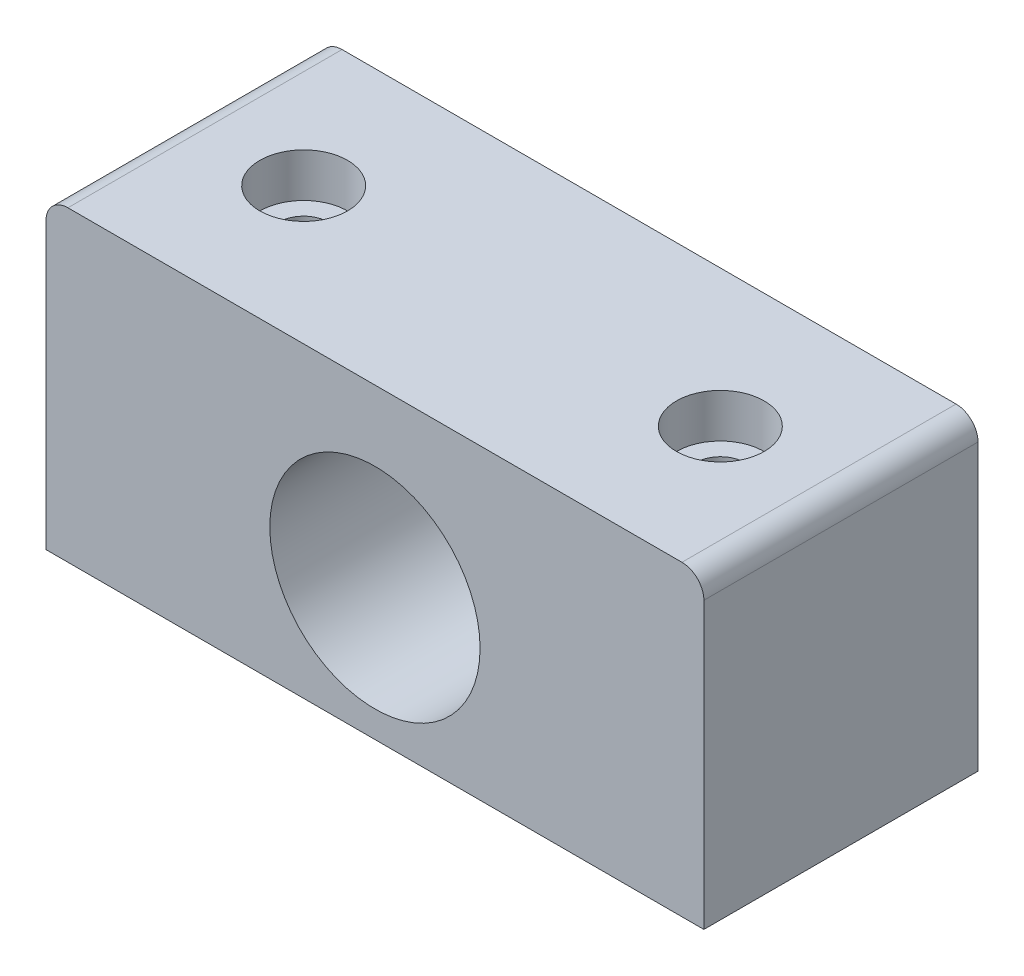
ISO-10303-21;
HEADER;
FILE_DESCRIPTION(('STEP AP214'),'2;1');
FILE_NAME('part.step','',(''),(''),'','','');
FILE_SCHEMA(('AUTOMOTIVE_DESIGN { 1 0 10303 214 1 1 1 1 }'));
ENDSEC;
DATA;
#1=APPLICATION_CONTEXT('core data for automotive mechanical design processes');
#2=APPLICATION_PROTOCOL_DEFINITION('international standard','automotive_design',2000,#1);
#3=PRODUCT_CONTEXT('',#1,'mechanical');
#4=PRODUCT('Part','Part','',(#3));
#5=PRODUCT_RELATED_PRODUCT_CATEGORY('part','',(#4));
#6=PRODUCT_DEFINITION_FORMATION('','',#4);
#7=PRODUCT_DEFINITION_CONTEXT('part definition',#1,'design');
#8=PRODUCT_DEFINITION('design','',#6,#7);
#9=PRODUCT_DEFINITION_SHAPE('','',#8);
#10=(LENGTH_UNIT() NAMED_UNIT(*) SI_UNIT(.MILLI.,.METRE.));
#11=(NAMED_UNIT(*) PLANE_ANGLE_UNIT() SI_UNIT($,.RADIAN.));
#12=(NAMED_UNIT(*) SI_UNIT($,.STERADIAN.) SOLID_ANGLE_UNIT());
#13=UNCERTAINTY_MEASURE_WITH_UNIT(LENGTH_MEASURE(1.E-05),#10,'distance_accuracy_value','');
#14=(GEOMETRIC_REPRESENTATION_CONTEXT(3) GLOBAL_UNCERTAINTY_ASSIGNED_CONTEXT((#13)) GLOBAL_UNIT_ASSIGNED_CONTEXT((#10,
#11,#12)) REPRESENTATION_CONTEXT('',''));
#15=CARTESIAN_POINT('',(0.,0.,0.));
#16=DIRECTION('',(0.,0.,1.));
#17=DIRECTION('',(1.,0.,0.));
#18=AXIS2_PLACEMENT_3D('',#15,#16,#17);
#19=CARTESIAN_POINT('',(30.,28.,12.5));
#20=DIRECTION('',(-1.,0.,0.));
#21=DIRECTION('',(0.,0.,1.));
#22=AXIS2_PLACEMENT_3D('',#19,#20,#21);
#23=PLANE('',#22);
#24=DIRECTION('',(0.,-1.,0.));
#25=VECTOR('',#24,1.);
#26=CARTESIAN_POINT('',(30.,28.,-12.5));
#27=LINE('',#26,#25);
#28=CARTESIAN_POINT('',(30.,26.,-12.5));
#29=VERTEX_POINT('',#28);
#30=CARTESIAN_POINT('',(30.,0.,-12.5));
#31=VERTEX_POINT('',#30);
#32=EDGE_CURVE('E85',#29,#31,#27,.T.);
#33=ORIENTED_EDGE('',*,*,#32,.F.);
#34=DIRECTION('',(0.,0.,-1.));
#35=VECTOR('',#34,1.);
#36=CARTESIAN_POINT('',(30.,26.,12.5));
#37=LINE('',#36,#35);
#38=CARTESIAN_POINT('',(30.,26.,12.5));
#39=VERTEX_POINT('',#38);
#40=EDGE_CURVE('E56',#29,#39,#37,.F.);
#41=ORIENTED_EDGE('',*,*,#40,.T.);
#42=DIRECTION('',(0.,-1.,0.));
#43=VECTOR('',#42,1.);
#44=CARTESIAN_POINT('',(30.,28.,12.5));
#45=LINE('',#44,#43);
#46=CARTESIAN_POINT('',(30.,0.,12.5));
#47=VERTEX_POINT('',#46);
#48=EDGE_CURVE('E105',#39,#47,#45,.T.);
#49=ORIENTED_EDGE('',*,*,#48,.T.);
#50=DIRECTION('',(0.,0.,-1.));
#51=VECTOR('',#50,1.);
#52=CARTESIAN_POINT('',(30.,0.,12.5));
#53=LINE('',#52,#51);
#54=EDGE_CURVE('E101',#47,#31,#53,.T.);
#55=ORIENTED_EDGE('',*,*,#54,.T.);
#56=EDGE_LOOP('',(#33,#41,#49,#55));
#57=FACE_BOUND('',#56,.T.);
#58=ADVANCED_FACE('F33',(#57),#23,.F.);
#59=CARTESIAN_POINT('',(-30.,28.,-12.5));
#60=DIRECTION('',(0.,0.,1.));
#61=DIRECTION('',(1.,0.,0.));
#62=AXIS2_PLACEMENT_3D('',#59,#60,#61);
#63=PLANE('',#62);
#64=CARTESIAN_POINT('',(0.,12.,-12.5));
#65=DIRECTION('',(0.,0.,1.));
#66=DIRECTION('',(1.,0.,0.));
#67=AXIS2_PLACEMENT_3D('',#64,#65,#66);
#68=CIRCLE('',#67,9.5885);
#69=CARTESIAN_POINT('',(9.5885,12.,-12.5));
#70=VERTEX_POINT('',#69);
#71=EDGE_CURVE('E107',#70,#70,#68,.T.);
#72=ORIENTED_EDGE('',*,*,#71,.T.);
#73=EDGE_LOOP('',(#72));
#74=FACE_BOUND('',#73,.T.);
#75=DIRECTION('',(-1.,0.,0.));
#76=VECTOR('',#75,1.);
#77=CARTESIAN_POINT('',(-30.,28.,-12.5));
#78=LINE('',#77,#76);
#79=CARTESIAN_POINT('',(28.,28.,-12.5));
#80=VERTEX_POINT('',#79);
#81=CARTESIAN_POINT('',(-28.,28.,-12.5));
#82=VERTEX_POINT('',#81);
#83=EDGE_CURVE('E119',#80,#82,#78,.T.);
#84=ORIENTED_EDGE('',*,*,#83,.F.);
#85=CARTESIAN_POINT('',(28.,26.,-12.5));
#86=DIRECTION('',(0.,0.,1.));
#87=DIRECTION('',(1.,0.,0.));
#88=AXIS2_PLACEMENT_3D('',#85,#86,#87);
#89=CIRCLE('',#88,2.);
#90=EDGE_CURVE('E92',#80,#29,#89,.F.);
#91=ORIENTED_EDGE('',*,*,#90,.T.);
#92=ORIENTED_EDGE('',*,*,#32,.T.);
#93=DIRECTION('',(-1.,0.,0.));
#94=VECTOR('',#93,1.);
#95=CARTESIAN_POINT('',(-30.,0.,-12.5));
#96=LINE('',#95,#94);
#97=CARTESIAN_POINT('',(-30.,0.,-12.5));
#98=VERTEX_POINT('',#97);
#99=EDGE_CURVE('E90',#31,#98,#96,.T.);
#100=ORIENTED_EDGE('',*,*,#99,.T.);
#101=DIRECTION('',(0.,-1.,0.));
#102=VECTOR('',#101,1.);
#103=CARTESIAN_POINT('',(-30.,28.,-12.5));
#104=LINE('',#103,#102);
#105=CARTESIAN_POINT('',(-30.,26.,-12.5));
#106=VERTEX_POINT('',#105);
#107=EDGE_CURVE('E95',#106,#98,#104,.T.);
#108=ORIENTED_EDGE('',*,*,#107,.F.);
#109=CARTESIAN_POINT('',(-28.,26.,-12.5));
#110=DIRECTION('',(0.,0.,1.));
#111=DIRECTION('',(1.,0.,0.));
#112=AXIS2_PLACEMENT_3D('',#109,#110,#111);
#113=CIRCLE('',#112,2.);
#114=EDGE_CURVE('E129',#106,#82,#113,.F.);
#115=ORIENTED_EDGE('',*,*,#114,.T.);
#116=EDGE_LOOP('',(#84,#91,#92,#100,#108,#115));
#117=FACE_BOUND('',#116,.T.);
#118=ADVANCED_FACE('F88',(#74,#117),#63,.F.);
#119=CARTESIAN_POINT('',(-30.,28.,12.5));
#120=DIRECTION('',(1.,0.,0.));
#121=DIRECTION('',(0.,0.,-1.));
#122=AXIS2_PLACEMENT_3D('',#119,#120,#121);
#123=PLANE('',#122);
#124=DIRECTION('',(0.,-1.,0.));
#125=VECTOR('',#124,1.);
#126=CARTESIAN_POINT('',(-30.,28.,12.5));
#127=LINE('',#126,#125);
#128=CARTESIAN_POINT('',(-30.,26.,12.5));
#129=VERTEX_POINT('',#128);
#130=CARTESIAN_POINT('',(-30.,0.,12.5));
#131=VERTEX_POINT('',#130);
#132=EDGE_CURVE('E121',#129,#131,#127,.T.);
#133=ORIENTED_EDGE('',*,*,#132,.F.);
#134=DIRECTION('',(0.,0.,1.));
#135=VECTOR('',#134,1.);
#136=CARTESIAN_POINT('',(-30.,26.,12.5));
#137=LINE('',#136,#135);
#138=EDGE_CURVE('E11',#129,#106,#137,.F.);
#139=ORIENTED_EDGE('',*,*,#138,.T.);
#140=ORIENTED_EDGE('',*,*,#107,.T.);
#141=DIRECTION('',(0.,0.,1.));
#142=VECTOR('',#141,1.);
#143=CARTESIAN_POINT('',(-30.,0.,12.5));
#144=LINE('',#143,#142);
#145=EDGE_CURVE('E103',#98,#131,#144,.T.);
#146=ORIENTED_EDGE('',*,*,#145,.T.);
#147=EDGE_LOOP('',(#133,#139,#140,#146));
#148=FACE_BOUND('',#147,.T.);
#149=ADVANCED_FACE('F158',(#148),#123,.F.);
#150=CARTESIAN_POINT('',(-30.,28.,12.5));
#151=DIRECTION('',(0.,0.,-1.));
#152=DIRECTION('',(-1.,0.,0.));
#153=AXIS2_PLACEMENT_3D('',#150,#151,#152);
#154=PLANE('',#153);
#155=CARTESIAN_POINT('',(0.,12.,12.5));
#156=DIRECTION('',(0.,0.,1.));
#157=DIRECTION('',(1.,0.,0.));
#158=AXIS2_PLACEMENT_3D('',#155,#156,#157);
#159=CIRCLE('',#158,9.5885);
#160=CARTESIAN_POINT('',(9.5885,12.,12.5));
#161=VERTEX_POINT('',#160);
#162=EDGE_CURVE('E110',#161,#161,#159,.T.);
#163=ORIENTED_EDGE('',*,*,#162,.F.);
#164=EDGE_LOOP('',(#163));
#165=FACE_BOUND('',#164,.T.);
#166=ORIENTED_EDGE('',*,*,#48,.F.);
#167=CARTESIAN_POINT('',(28.,26.,12.5));
#168=DIRECTION('',(0.,0.,-1.));
#169=DIRECTION('',(-1.,0.,0.));
#170=AXIS2_PLACEMENT_3D('',#167,#168,#169);
#171=CIRCLE('',#170,2.);
#172=CARTESIAN_POINT('',(28.,28.,12.5));
#173=VERTEX_POINT('',#172);
#174=EDGE_CURVE('E41',#39,#173,#171,.F.);
#175=ORIENTED_EDGE('',*,*,#174,.T.);
#176=DIRECTION('',(1.,0.,0.));
#177=VECTOR('',#176,1.);
#178=CARTESIAN_POINT('',(-30.,28.,12.5));
#179=LINE('',#178,#177);
#180=CARTESIAN_POINT('',(-28.,28.,12.5));
#181=VERTEX_POINT('',#180);
#182=EDGE_CURVE('E113',#181,#173,#179,.T.);
#183=ORIENTED_EDGE('',*,*,#182,.F.);
#184=CARTESIAN_POINT('',(-28.,26.,12.5));
#185=DIRECTION('',(0.,0.,-1.));
#186=DIRECTION('',(-1.,0.,0.));
#187=AXIS2_PLACEMENT_3D('',#184,#185,#186);
#188=CIRCLE('',#187,2.);
#189=EDGE_CURVE('E48',#181,#129,#188,.F.);
#190=ORIENTED_EDGE('',*,*,#189,.T.);
#191=ORIENTED_EDGE('',*,*,#132,.T.);
#192=DIRECTION('',(1.,0.,0.));
#193=VECTOR('',#192,1.);
#194=CARTESIAN_POINT('',(-30.,0.,12.5));
#195=LINE('',#194,#193);
#196=EDGE_CURVE('E117',#131,#47,#195,.T.);
#197=ORIENTED_EDGE('',*,*,#196,.T.);
#198=EDGE_LOOP('',(#166,#175,#183,#190,#191,#197));
#199=FACE_BOUND('',#198,.T.);
#200=ADVANCED_FACE('F135',(#165,#199),#154,.F.);
#201=CARTESIAN_POINT('',(0.,28.,0.));
#202=DIRECTION('',(0.,-1.,0.));
#203=DIRECTION('',(0.,0.,-1.));
#204=AXIS2_PLACEMENT_3D('',#201,#202,#203);
#205=PLANE('',#204);
#206=CARTESIAN_POINT('',(-19.,28.,0.));
#207=DIRECTION('',(0.,1.,0.));
#208=DIRECTION('',(0.,0.,1.));
#209=AXIS2_PLACEMENT_3D('',#206,#207,#208);
#210=CIRCLE('',#209,4.);
#211=CARTESIAN_POINT('',(-19.,28.,4.));
#212=VERTEX_POINT('',#211);
#213=EDGE_CURVE('E205',#212,#212,#210,.T.);
#214=ORIENTED_EDGE('',*,*,#213,.F.);
#215=EDGE_LOOP('',(#214));
#216=FACE_BOUND('',#215,.T.);
#217=CARTESIAN_POINT('',(19.,28.,0.));
#218=DIRECTION('',(0.,1.,0.));
#219=DIRECTION('',(0.,0.,1.));
#220=AXIS2_PLACEMENT_3D('',#217,#218,#219);
#221=CIRCLE('',#220,4.);
#222=CARTESIAN_POINT('',(19.,28.,4.));
#223=VERTEX_POINT('',#222);
#224=EDGE_CURVE('E214',#223,#223,#221,.T.);
#225=ORIENTED_EDGE('',*,*,#224,.F.);
#226=EDGE_LOOP('',(#225));
#227=FACE_BOUND('',#226,.T.);
#228=ORIENTED_EDGE('',*,*,#182,.T.);
#229=DIRECTION('',(0.,0.,-1.));
#230=VECTOR('',#229,1.);
#231=CARTESIAN_POINT('',(28.,28.,0.));
#232=LINE('',#231,#230);
#233=EDGE_CURVE('E126',#173,#80,#232,.T.);
#234=ORIENTED_EDGE('',*,*,#233,.T.);
#235=ORIENTED_EDGE('',*,*,#83,.T.);
#236=DIRECTION('',(0.,0.,1.));
#237=VECTOR('',#236,1.);
#238=CARTESIAN_POINT('',(-28.,28.,0.));
#239=LINE('',#238,#237);
#240=EDGE_CURVE('E94',#82,#181,#239,.T.);
#241=ORIENTED_EDGE('',*,*,#240,.T.);
#242=EDGE_LOOP('',(#228,#234,#235,#241));
#243=FACE_BOUND('',#242,.T.);
#244=ADVANCED_FACE('F139',(#216,#227,#243),#205,.F.);
#245=CARTESIAN_POINT('',(0.,0.,0.));
#246=DIRECTION('',(0.,-1.,0.));
#247=DIRECTION('',(0.,0.,-1.));
#248=AXIS2_PLACEMENT_3D('',#245,#246,#247);
#249=PLANE('',#248);
#250=CARTESIAN_POINT('',(-19.,0.,0.));
#251=DIRECTION('',(0.,1.,0.));
#252=DIRECTION('',(0.,0.,1.));
#253=AXIS2_PLACEMENT_3D('',#250,#251,#252);
#254=CIRCLE('',#253,2.25);
#255=CARTESIAN_POINT('',(-19.,0.,2.25));
#256=VERTEX_POINT('',#255);
#257=EDGE_CURVE('E207',#256,#256,#254,.T.);
#258=ORIENTED_EDGE('',*,*,#257,.T.);
#259=EDGE_LOOP('',(#258));
#260=FACE_BOUND('',#259,.T.);
#261=CARTESIAN_POINT('',(19.,0.,0.));
#262=DIRECTION('',(0.,1.,0.));
#263=DIRECTION('',(0.,0.,1.));
#264=AXIS2_PLACEMENT_3D('',#261,#262,#263);
#265=CIRCLE('',#264,2.25);
#266=CARTESIAN_POINT('',(19.,0.,2.25));
#267=VERTEX_POINT('',#266);
#268=EDGE_CURVE('E223',#267,#267,#265,.T.);
#269=ORIENTED_EDGE('',*,*,#268,.T.);
#270=EDGE_LOOP('',(#269));
#271=FACE_BOUND('',#270,.T.);
#272=ORIENTED_EDGE('',*,*,#54,.F.);
#273=ORIENTED_EDGE('',*,*,#196,.F.);
#274=ORIENTED_EDGE('',*,*,#145,.F.);
#275=ORIENTED_EDGE('',*,*,#99,.F.);
#276=EDGE_LOOP('',(#272,#273,#274,#275));
#277=FACE_BOUND('',#276,.T.);
#278=ADVANCED_FACE('F99',(#260,#271,#277),#249,.T.);
#279=CARTESIAN_POINT('',(0.,12.,-12.5));
#280=DIRECTION('',(0.,0.,1.));
#281=DIRECTION('',(1.,0.,0.));
#282=AXIS2_PLACEMENT_3D('',#279,#280,#281);
#283=CYLINDRICAL_SURFACE('',#282,9.5885);
#284=ORIENTED_EDGE('',*,*,#71,.F.);
#285=EDGE_LOOP('',(#284));
#286=FACE_BOUND('',#285,.T.);
#287=ORIENTED_EDGE('',*,*,#162,.T.);
#288=EDGE_LOOP('',(#287));
#289=FACE_BOUND('',#288,.T.);
#290=ADVANCED_FACE('F170',(#286,#289),#283,.F.);
#291=CARTESIAN_POINT('',(19.,28.,0.));
#292=DIRECTION('',(0.,1.,0.));
#293=DIRECTION('',(0.,0.,1.));
#294=AXIS2_PLACEMENT_3D('',#291,#292,#293);
#295=CYLINDRICAL_SURFACE('',#294,2.25);
#296=ORIENTED_EDGE('',*,*,#268,.F.);
#297=EDGE_LOOP('',(#296));
#298=FACE_BOUND('',#297,.T.);
#299=CARTESIAN_POINT('',(19.,24.,0.));
#300=DIRECTION('',(0.,1.,0.));
#301=DIRECTION('',(0.,0.,1.));
#302=AXIS2_PLACEMENT_3D('',#299,#300,#301);
#303=CIRCLE('',#302,2.25);
#304=CARTESIAN_POINT('',(19.,24.,2.25));
#305=VERTEX_POINT('',#304);
#306=EDGE_CURVE('E220',#305,#305,#303,.T.);
#307=ORIENTED_EDGE('',*,*,#306,.T.);
#308=EDGE_LOOP('',(#307));
#309=FACE_BOUND('',#308,.T.);
#310=ADVANCED_FACE('F177',(#298,#309),#295,.F.);
#311=CARTESIAN_POINT('',(21.25,24.,0.));
#312=DIRECTION('',(0.,-1.,0.));
#313=DIRECTION('',(0.,0.,-1.));
#314=AXIS2_PLACEMENT_3D('',#311,#312,#313);
#315=PLANE('',#314);
#316=ORIENTED_EDGE('',*,*,#306,.F.);
#317=EDGE_LOOP('',(#316));
#318=FACE_BOUND('',#317,.T.);
#319=CARTESIAN_POINT('',(19.,24.,0.));
#320=DIRECTION('',(0.,1.,0.));
#321=DIRECTION('',(0.,0.,1.));
#322=AXIS2_PLACEMENT_3D('',#319,#320,#321);
#323=CIRCLE('',#322,4.);
#324=CARTESIAN_POINT('',(19.,24.,4.));
#325=VERTEX_POINT('',#324);
#326=EDGE_CURVE('E217',#325,#325,#323,.T.);
#327=ORIENTED_EDGE('',*,*,#326,.T.);
#328=EDGE_LOOP('',(#327));
#329=FACE_BOUND('',#328,.T.);
#330=ADVANCED_FACE('F181',(#318,#329),#315,.F.);
#331=CARTESIAN_POINT('',(19.,28.,0.));
#332=DIRECTION('',(0.,1.,0.));
#333=DIRECTION('',(0.,0.,1.));
#334=AXIS2_PLACEMENT_3D('',#331,#332,#333);
#335=CYLINDRICAL_SURFACE('',#334,4.);
#336=ORIENTED_EDGE('',*,*,#326,.F.);
#337=EDGE_LOOP('',(#336));
#338=FACE_BOUND('',#337,.T.);
#339=ORIENTED_EDGE('',*,*,#224,.T.);
#340=EDGE_LOOP('',(#339));
#341=FACE_BOUND('',#340,.T.);
#342=ADVANCED_FACE('F185',(#338,#341),#335,.F.);
#343=CARTESIAN_POINT('',(-19.,28.,0.));
#344=DIRECTION('',(0.,1.,0.));
#345=DIRECTION('',(0.,0.,1.));
#346=AXIS2_PLACEMENT_3D('',#343,#344,#345);
#347=CYLINDRICAL_SURFACE('',#346,2.25);
#348=ORIENTED_EDGE('',*,*,#257,.F.);
#349=EDGE_LOOP('',(#348));
#350=FACE_BOUND('',#349,.T.);
#351=CARTESIAN_POINT('',(-19.,24.,0.));
#352=DIRECTION('',(0.,1.,0.));
#353=DIRECTION('',(0.,0.,1.));
#354=AXIS2_PLACEMENT_3D('',#351,#352,#353);
#355=CIRCLE('',#354,2.25);
#356=CARTESIAN_POINT('',(-19.,24.,2.25));
#357=VERTEX_POINT('',#356);
#358=EDGE_CURVE('E201',#357,#357,#355,.T.);
#359=ORIENTED_EDGE('',*,*,#358,.T.);
#360=EDGE_LOOP('',(#359));
#361=FACE_BOUND('',#360,.T.);
#362=ADVANCED_FACE('F189',(#350,#361),#347,.F.);
#363=CARTESIAN_POINT('',(-16.75,24.,0.));
#364=DIRECTION('',(0.,-1.,0.));
#365=DIRECTION('',(0.,0.,-1.));
#366=AXIS2_PLACEMENT_3D('',#363,#364,#365);
#367=PLANE('',#366);
#368=ORIENTED_EDGE('',*,*,#358,.F.);
#369=EDGE_LOOP('',(#368));
#370=FACE_BOUND('',#369,.T.);
#371=CARTESIAN_POINT('',(-19.,24.,0.));
#372=DIRECTION('',(0.,1.,0.));
#373=DIRECTION('',(0.,0.,1.));
#374=AXIS2_PLACEMENT_3D('',#371,#372,#373);
#375=CIRCLE('',#374,4.);
#376=CARTESIAN_POINT('',(-19.,24.,4.));
#377=VERTEX_POINT('',#376);
#378=EDGE_CURVE('E204',#377,#377,#375,.T.);
#379=ORIENTED_EDGE('',*,*,#378,.T.);
#380=EDGE_LOOP('',(#379));
#381=FACE_BOUND('',#380,.T.);
#382=ADVANCED_FACE('F150',(#370,#381),#367,.F.);
#383=CARTESIAN_POINT('',(-19.,28.,0.));
#384=DIRECTION('',(0.,1.,0.));
#385=DIRECTION('',(0.,0.,1.));
#386=AXIS2_PLACEMENT_3D('',#383,#384,#385);
#387=CYLINDRICAL_SURFACE('',#386,4.);
#388=ORIENTED_EDGE('',*,*,#378,.F.);
#389=EDGE_LOOP('',(#388));
#390=FACE_BOUND('',#389,.T.);
#391=ORIENTED_EDGE('',*,*,#213,.T.);
#392=EDGE_LOOP('',(#391));
#393=FACE_BOUND('',#392,.T.);
#394=ADVANCED_FACE('F144',(#390,#393),#387,.F.);
#395=CARTESIAN_POINT('',(28.,26.,0.));
#396=DIRECTION('',(0.,0.,-1.));
#397=DIRECTION('',(-1.,0.,0.));
#398=AXIS2_PLACEMENT_3D('',#395,#396,#397);
#399=CYLINDRICAL_SURFACE('',#398,2.);
#400=ORIENTED_EDGE('',*,*,#174,.F.);
#401=ORIENTED_EDGE('',*,*,#40,.F.);
#402=ORIENTED_EDGE('',*,*,#90,.F.);
#403=ORIENTED_EDGE('',*,*,#233,.F.);
#404=EDGE_LOOP('',(#400,#401,#402,#403));
#405=FACE_BOUND('',#404,.T.);
#406=ADVANCED_FACE('F142',(#405),#399,.T.);
#407=CARTESIAN_POINT('',(-28.,26.,0.));
#408=DIRECTION('',(0.,0.,1.));
#409=DIRECTION('',(1.,0.,0.));
#410=AXIS2_PLACEMENT_3D('',#407,#408,#409);
#411=CYLINDRICAL_SURFACE('',#410,2.);
#412=ORIENTED_EDGE('',*,*,#114,.F.);
#413=ORIENTED_EDGE('',*,*,#138,.F.);
#414=ORIENTED_EDGE('',*,*,#189,.F.);
#415=ORIENTED_EDGE('',*,*,#240,.F.);
#416=EDGE_LOOP('',(#412,#413,#414,#415));
#417=FACE_BOUND('',#416,.T.);
#418=ADVANCED_FACE('F35',(#417),#411,.T.);
#419=CLOSED_SHELL('',(#58,#118,#149,#200,#244,#278,#290,#310,#330,#342,#362,#382,#394,#406,#418));
#420=MANIFOLD_SOLID_BREP('B2',#419);
#421=ADVANCED_BREP_SHAPE_REPRESENTATION('',(#18,#420),#14);
#422=SHAPE_DEFINITION_REPRESENTATION(#9,#421);
ENDSEC;
END-ISO-10303-21;
